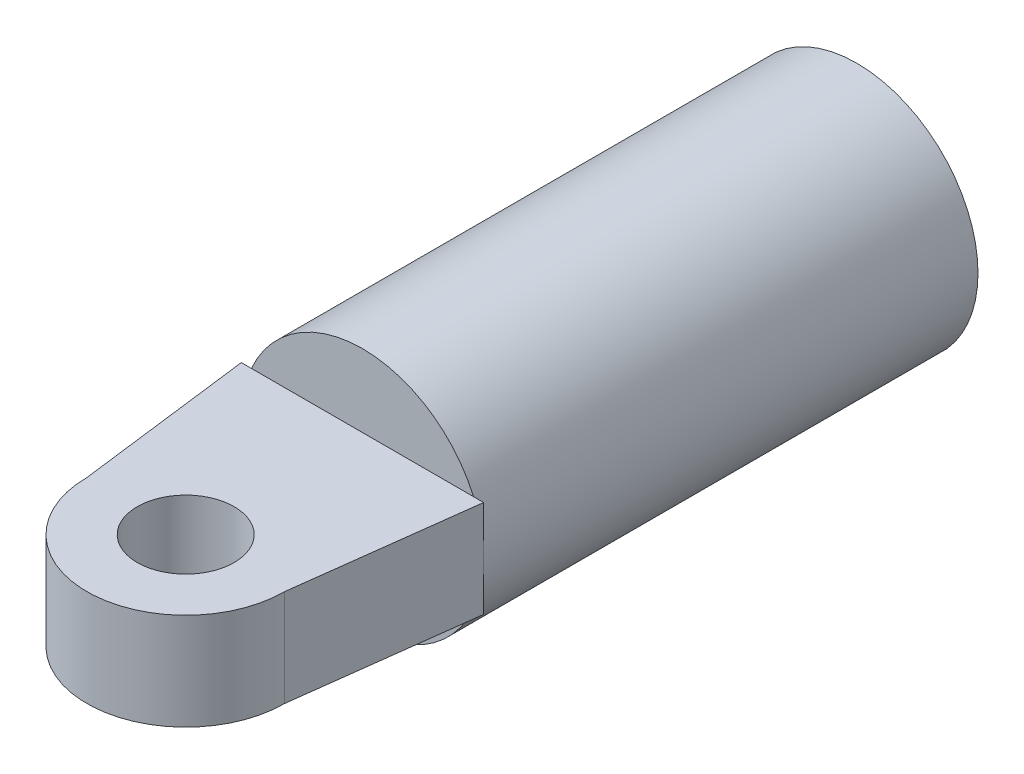
ISO-10303-21;
HEADER;
FILE_DESCRIPTION(('STEP AP214'),'2;1');
FILE_NAME('part.step','',(''),(''),'','','');
FILE_SCHEMA(('AUTOMOTIVE_DESIGN { 1 0 10303 214 1 1 1 1 }'));
ENDSEC;
DATA;
#1=APPLICATION_CONTEXT('core data for automotive mechanical design processes');
#2=APPLICATION_PROTOCOL_DEFINITION('international standard','automotive_design',2000,#1);
#3=PRODUCT_CONTEXT('',#1,'mechanical');
#4=PRODUCT('Part','Part','',(#3));
#5=PRODUCT_RELATED_PRODUCT_CATEGORY('part','',(#4));
#6=PRODUCT_DEFINITION_FORMATION('','',#4);
#7=PRODUCT_DEFINITION_CONTEXT('part definition',#1,'design');
#8=PRODUCT_DEFINITION('design','',#6,#7);
#9=PRODUCT_DEFINITION_SHAPE('','',#8);
#10=(LENGTH_UNIT() NAMED_UNIT(*) SI_UNIT(.MILLI.,.METRE.));
#11=(NAMED_UNIT(*) PLANE_ANGLE_UNIT() SI_UNIT($,.RADIAN.));
#12=(NAMED_UNIT(*) SI_UNIT($,.STERADIAN.) SOLID_ANGLE_UNIT());
#13=UNCERTAINTY_MEASURE_WITH_UNIT(LENGTH_MEASURE(1.E-05),#10,'distance_accuracy_value','');
#14=(GEOMETRIC_REPRESENTATION_CONTEXT(3) GLOBAL_UNCERTAINTY_ASSIGNED_CONTEXT((#13)) GLOBAL_UNIT_ASSIGNED_CONTEXT((#10,
#11,#12)) REPRESENTATION_CONTEXT('',''));
#15=CARTESIAN_POINT('',(0.,0.,0.));
#16=DIRECTION('',(0.,0.,1.));
#17=DIRECTION('',(1.,0.,0.));
#18=AXIS2_PLACEMENT_3D('',#15,#16,#17);
#19=CARTESIAN_POINT('',(0.,0.,51.));
#20=DIRECTION('',(0.,0.,1.));
#21=DIRECTION('',(1.,0.,0.));
#22=AXIS2_PLACEMENT_3D('',#19,#20,#21);
#23=PLANE('',#22);
#24=CARTESIAN_POINT('',(0.,0.,51.));
#25=DIRECTION('',(0.,0.,1.));
#26=DIRECTION('',(1.,0.,0.));
#27=AXIS2_PLACEMENT_3D('',#24,#25,#26);
#28=CIRCLE('',#27,12.5);
#29=CARTESIAN_POINT('',(-11.4564392373896,-5.,51.));
#30=VERTEX_POINT('',#29);
#31=CARTESIAN_POINT('',(11.4564392373896,-5.,51.));
#32=VERTEX_POINT('',#31);
#33=EDGE_CURVE('E154',#30,#32,#28,.T.);
#34=ORIENTED_EDGE('',*,*,#33,.T.);
#35=DIRECTION('',(-1.,0.,0.));
#36=VECTOR('',#35,1.);
#37=CARTESIAN_POINT('',(-12.5,-5.,51.));
#38=LINE('',#37,#36);
#39=EDGE_CURVE('E44',#32,#30,#38,.T.);
#40=ORIENTED_EDGE('',*,*,#39,.T.);
#41=EDGE_LOOP('',(#34,#40));
#42=FACE_BOUND('',#41,.T.);
#43=ADVANCED_FACE('F35',(#42),#23,.T.);
#44=CARTESIAN_POINT('',(0.,0.,51.));
#45=DIRECTION('',(0.,0.,-1.));
#46=DIRECTION('',(-1.,0.,0.));
#47=AXIS2_PLACEMENT_3D('',#44,#45,#46);
#48=CYLINDRICAL_SURFACE('',#47,12.5);
#49=CARTESIAN_POINT('',(12.5,0.,51.));
#50=VERTEX_POINT('',#49);
#51=CARTESIAN_POINT('',(11.4564392373896,5.,51.));
#52=VERTEX_POINT('',#51);
#53=EDGE_CURVE('E147',#50,#52,#28,.T.);
#54=ORIENTED_EDGE('',*,*,#53,.F.);
#55=EDGE_CURVE('E149',#32,#50,#28,.T.);
#56=ORIENTED_EDGE('',*,*,#55,.F.);
#57=ORIENTED_EDGE('',*,*,#33,.F.);
#58=CARTESIAN_POINT('',(-12.5,0.,51.));
#59=VERTEX_POINT('',#58);
#60=EDGE_CURVE('E158',#59,#30,#28,.T.);
#61=ORIENTED_EDGE('',*,*,#60,.F.);
#62=CARTESIAN_POINT('',(-11.4564392373896,5.,51.));
#63=VERTEX_POINT('',#62);
#64=EDGE_CURVE('E153',#63,#59,#28,.T.);
#65=ORIENTED_EDGE('',*,*,#64,.F.);
#66=EDGE_CURVE('E148',#52,#63,#28,.T.);
#67=ORIENTED_EDGE('',*,*,#66,.F.);
#68=EDGE_LOOP('',(#54,#56,#57,#61,#65,#67));
#69=FACE_BOUND('',#68,.T.);
#70=CARTESIAN_POINT('',(0.,0.,0.));
#71=DIRECTION('',(0.,0.,1.));
#72=DIRECTION('',(1.,0.,0.));
#73=AXIS2_PLACEMENT_3D('',#70,#71,#72);
#74=CIRCLE('',#73,12.5);
#75=CARTESIAN_POINT('',(12.5,0.,0.));
#76=VERTEX_POINT('',#75);
#77=EDGE_CURVE('E39',#76,#76,#74,.T.);
#78=ORIENTED_EDGE('',*,*,#77,.T.);
#79=EDGE_LOOP('',(#78));
#80=FACE_BOUND('',#79,.T.);
#81=ADVANCED_FACE('F37',(#69,#80),#48,.T.);
#82=DIRECTION('',(-1.,0.,0.));
#83=VECTOR('',#82,1.);
#84=CARTESIAN_POINT('',(-12.5,5.,51.));
#85=LINE('',#84,#83);
#86=EDGE_CURVE('E11',#52,#63,#85,.T.);
#87=ORIENTED_EDGE('',*,*,#86,.F.);
#88=ORIENTED_EDGE('',*,*,#66,.T.);
#89=EDGE_LOOP('',(#87,#88));
#90=FACE_BOUND('',#89,.T.);
#91=ADVANCED_FACE('F166',(#90),#23,.T.);
#92=CARTESIAN_POINT('',(0.,0.,0.));
#93=DIRECTION('',(0.,0.,1.));
#94=DIRECTION('',(1.,0.,0.));
#95=AXIS2_PLACEMENT_3D('',#92,#93,#94);
#96=PLANE('',#95);
#97=ORIENTED_EDGE('',*,*,#77,.F.);
#98=EDGE_LOOP('',(#97));
#99=FACE_BOUND('',#98,.T.);
#100=ADVANCED_FACE('F163',(#99),#96,.F.);
#101=CARTESIAN_POINT('',(-12.5,-5.,51.));
#102=DIRECTION('',(0.,0.,-1.));
#103=DIRECTION('',(-1.,0.,0.));
#104=AXIS2_PLACEMENT_3D('',#101,#102,#103);
#105=PLANE('',#104);
#106=CARTESIAN_POINT('',(-12.5,5.,51.));
#107=VERTEX_POINT('',#106);
#108=EDGE_CURVE('E47',#63,#107,#85,.T.);
#109=ORIENTED_EDGE('',*,*,#108,.F.);
#110=ORIENTED_EDGE('',*,*,#64,.T.);
#111=DIRECTION('',(0.,1.,0.));
#112=VECTOR('',#111,1.);
#113=CARTESIAN_POINT('',(-12.5,-5.,51.));
#114=LINE('',#113,#112);
#115=EDGE_CURVE('E145',#59,#107,#114,.T.);
#116=ORIENTED_EDGE('',*,*,#115,.T.);
#117=EDGE_LOOP('',(#109,#110,#116));
#118=FACE_BOUND('',#117,.T.);
#119=ADVANCED_FACE('F165',(#118),#105,.T.);
#120=CARTESIAN_POINT('',(-12.5,-5.,51.));
#121=VERTEX_POINT('',#120);
#122=EDGE_CURVE('E142',#121,#59,#114,.T.);
#123=ORIENTED_EDGE('',*,*,#122,.T.);
#124=ORIENTED_EDGE('',*,*,#60,.T.);
#125=EDGE_CURVE('E54',#30,#121,#38,.T.);
#126=ORIENTED_EDGE('',*,*,#125,.T.);
#127=EDGE_LOOP('',(#123,#124,#126));
#128=FACE_BOUND('',#127,.T.);
#129=ADVANCED_FACE('F172',(#128),#105,.T.);
#130=DIRECTION('',(0.,1.,0.));
#131=VECTOR('',#130,1.);
#132=CARTESIAN_POINT('',(12.5,-5.,51.));
#133=LINE('',#132,#131);
#134=CARTESIAN_POINT('',(12.5,5.,51.));
#135=VERTEX_POINT('',#134);
#136=EDGE_CURVE('E107',#50,#135,#133,.T.);
#137=ORIENTED_EDGE('',*,*,#136,.F.);
#138=ORIENTED_EDGE('',*,*,#53,.T.);
#139=EDGE_CURVE('E46',#135,#52,#85,.T.);
#140=ORIENTED_EDGE('',*,*,#139,.F.);
#141=EDGE_LOOP('',(#137,#138,#140));
#142=FACE_BOUND('',#141,.T.);
#143=ADVANCED_FACE('F189',(#142),#105,.T.);
#144=CARTESIAN_POINT('',(0.,-5.,69.2353941051635));
#145=DIRECTION('',(0.,1.,0.));
#146=DIRECTION('',(0.,0.,1.));
#147=AXIS2_PLACEMENT_3D('',#144,#145,#146);
#148=CYLINDRICAL_SURFACE('',#147,10.1941541977514);
#149=DIRECTION('',(0.,1.,0.));
#150=VECTOR('',#149,1.);
#151=CARTESIAN_POINT('',(10.1941541977514,-5.,69.2353941051635));
#152=LINE('',#151,#150);
#153=CARTESIAN_POINT('',(10.1941541977514,-5.,69.2353941051635));
#154=VERTEX_POINT('',#153);
#155=CARTESIAN_POINT('',(10.1941541977514,5.,69.2353941051635));
#156=VERTEX_POINT('',#155);
#157=EDGE_CURVE('E97',#154,#156,#152,.T.);
#158=ORIENTED_EDGE('',*,*,#157,.T.);
#159=CARTESIAN_POINT('',(0.,5.,69.2353941051635));
#160=DIRECTION('',(0.,1.,0.));
#161=DIRECTION('',(0.,0.,1.));
#162=AXIS2_PLACEMENT_3D('',#159,#160,#161);
#163=CIRCLE('',#162,10.1941541977514);
#164=CARTESIAN_POINT('',(-10.1941541977514,5.,69.2353941051635));
#165=VERTEX_POINT('',#164);
#166=EDGE_CURVE('E101',#165,#156,#163,.T.);
#167=ORIENTED_EDGE('',*,*,#166,.F.);
#168=DIRECTION('',(0.,1.,0.));
#169=VECTOR('',#168,1.);
#170=CARTESIAN_POINT('',(-10.1941541977514,-5.,69.2353941051635));
#171=LINE('',#170,#169);
#172=CARTESIAN_POINT('',(-10.1941541977514,-5.,69.2353941051635));
#173=VERTEX_POINT('',#172);
#174=EDGE_CURVE('E140',#173,#165,#171,.T.);
#175=ORIENTED_EDGE('',*,*,#174,.F.);
#176=CARTESIAN_POINT('',(0.,-5.,69.2353941051635));
#177=DIRECTION('',(0.,1.,0.));
#178=DIRECTION('',(0.,0.,1.));
#179=AXIS2_PLACEMENT_3D('',#176,#177,#178);
#180=CIRCLE('',#179,10.1941541977514);
#181=EDGE_CURVE('E103',#173,#154,#180,.T.);
#182=ORIENTED_EDGE('',*,*,#181,.T.);
#183=EDGE_LOOP('',(#158,#167,#175,#182));
#184=FACE_BOUND('',#183,.T.);
#185=ADVANCED_FACE('F99',(#184),#148,.T.);
#186=CARTESIAN_POINT('',(-10.1941541977514,-5.,69.2353941051635));
#187=DIRECTION('',(-0.992099948085262,0.,0.12544996217305));
#188=DIRECTION('',(0.12544996217305,0.,0.992099948085262));
#189=AXIS2_PLACEMENT_3D('',#186,#187,#188);
#190=PLANE('',#189);
#191=ORIENTED_EDGE('',*,*,#174,.T.);
#192=DIRECTION('',(0.12544996217305,0.,0.992099948085262));
#193=VECTOR('',#192,1.);
#194=CARTESIAN_POINT('',(-10.1941541977514,5.,69.2353941051635));
#195=LINE('',#194,#193);
#196=EDGE_CURVE('E123',#107,#165,#195,.T.);
#197=ORIENTED_EDGE('',*,*,#196,.F.);
#198=ORIENTED_EDGE('',*,*,#115,.F.);
#199=ORIENTED_EDGE('',*,*,#122,.F.);
#200=DIRECTION('',(0.12544996217305,0.,0.992099948085262));
#201=VECTOR('',#200,1.);
#202=CARTESIAN_POINT('',(-10.1941541977514,-5.,69.2353941051635));
#203=LINE('',#202,#201);
#204=EDGE_CURVE('E108',#121,#173,#203,.T.);
#205=ORIENTED_EDGE('',*,*,#204,.T.);
#206=EDGE_LOOP('',(#191,#197,#198,#199,#205));
#207=FACE_BOUND('',#206,.T.);
#208=ADVANCED_FACE('F188',(#207),#190,.T.);
#209=CARTESIAN_POINT('',(12.5,-5.,51.));
#210=VERTEX_POINT('',#209);
#211=EDGE_CURVE('E136',#210,#32,#38,.T.);
#212=ORIENTED_EDGE('',*,*,#211,.T.);
#213=ORIENTED_EDGE('',*,*,#55,.T.);
#214=EDGE_CURVE('E146',#210,#50,#133,.T.);
#215=ORIENTED_EDGE('',*,*,#214,.F.);
#216=EDGE_LOOP('',(#212,#213,#215));
#217=FACE_BOUND('',#216,.T.);
#218=ADVANCED_FACE('F175',(#217),#105,.T.);
#219=CARTESIAN_POINT('',(12.5,-5.,51.));
#220=DIRECTION('',(0.992099948085262,0.,0.12544996217305));
#221=DIRECTION('',(0.12544996217305,0.,-0.992099948085262));
#222=AXIS2_PLACEMENT_3D('',#219,#220,#221);
#223=PLANE('',#222);
#224=ORIENTED_EDGE('',*,*,#214,.T.);
#225=ORIENTED_EDGE('',*,*,#136,.T.);
#226=DIRECTION('',(0.12544996217305,0.,-0.992099948085262));
#227=VECTOR('',#226,1.);
#228=CARTESIAN_POINT('',(12.5,5.,51.));
#229=LINE('',#228,#227);
#230=EDGE_CURVE('E111',#156,#135,#229,.T.);
#231=ORIENTED_EDGE('',*,*,#230,.F.);
#232=ORIENTED_EDGE('',*,*,#157,.F.);
#233=DIRECTION('',(0.12544996217305,0.,-0.992099948085262));
#234=VECTOR('',#233,1.);
#235=CARTESIAN_POINT('',(12.5,-5.,51.));
#236=LINE('',#235,#234);
#237=EDGE_CURVE('E134',#154,#210,#236,.T.);
#238=ORIENTED_EDGE('',*,*,#237,.T.);
#239=EDGE_LOOP('',(#224,#225,#231,#232,#238));
#240=FACE_BOUND('',#239,.T.);
#241=ADVANCED_FACE('F113',(#240),#223,.T.);
#242=CARTESIAN_POINT('',(0.,-5.,69.2353941051635));
#243=DIRECTION('',(0.,1.,0.));
#244=DIRECTION('',(0.,0.,1.));
#245=AXIS2_PLACEMENT_3D('',#242,#243,#244);
#246=PLANE('',#245);
#247=CARTESIAN_POINT('',(0.,-5.,69.2353941051635));
#248=DIRECTION('',(0.,1.,0.));
#249=DIRECTION('',(0.,0.,1.));
#250=AXIS2_PLACEMENT_3D('',#247,#248,#249);
#251=CIRCLE('',#250,4.9995110772038);
#252=CARTESIAN_POINT('',(0.,-5.,74.2349051823673));
#253=VERTEX_POINT('',#252);
#254=EDGE_CURVE('E130',#253,#253,#251,.T.);
#255=ORIENTED_EDGE('',*,*,#254,.T.);
#256=EDGE_LOOP('',(#255));
#257=FACE_BOUND('',#256,.T.);
#258=ORIENTED_EDGE('',*,*,#181,.F.);
#259=ORIENTED_EDGE('',*,*,#204,.F.);
#260=ORIENTED_EDGE('',*,*,#125,.F.);
#261=ORIENTED_EDGE('',*,*,#39,.F.);
#262=ORIENTED_EDGE('',*,*,#211,.F.);
#263=ORIENTED_EDGE('',*,*,#237,.F.);
#264=EDGE_LOOP('',(#258,#259,#260,#261,#262,#263));
#265=FACE_BOUND('',#264,.T.);
#266=ADVANCED_FACE('F191',(#257,#265),#246,.F.);
#267=CARTESIAN_POINT('',(0.,-5.,69.2353941051635));
#268=DIRECTION('',(0.,1.,0.));
#269=DIRECTION('',(0.,0.,1.));
#270=AXIS2_PLACEMENT_3D('',#267,#268,#269);
#271=CYLINDRICAL_SURFACE('',#270,4.9995110772038);
#272=ORIENTED_EDGE('',*,*,#254,.F.);
#273=EDGE_LOOP('',(#272));
#274=FACE_BOUND('',#273,.T.);
#275=CARTESIAN_POINT('',(0.,5.,69.2353941051635));
#276=DIRECTION('',(0.,1.,0.));
#277=DIRECTION('',(0.,0.,1.));
#278=AXIS2_PLACEMENT_3D('',#275,#276,#277);
#279=CIRCLE('',#278,4.9995110772038);
#280=CARTESIAN_POINT('',(0.,5.,74.2349051823673));
#281=VERTEX_POINT('',#280);
#282=EDGE_CURVE('E124',#281,#281,#279,.T.);
#283=ORIENTED_EDGE('',*,*,#282,.T.);
#284=EDGE_LOOP('',(#283));
#285=FACE_BOUND('',#284,.T.);
#286=ADVANCED_FACE('F199',(#274,#285),#271,.F.);
#287=CARTESIAN_POINT('',(0.,5.,69.2353941051635));
#288=DIRECTION('',(0.,1.,0.));
#289=DIRECTION('',(0.,0.,1.));
#290=AXIS2_PLACEMENT_3D('',#287,#288,#289);
#291=PLANE('',#290);
#292=ORIENTED_EDGE('',*,*,#166,.T.);
#293=ORIENTED_EDGE('',*,*,#230,.T.);
#294=ORIENTED_EDGE('',*,*,#139,.T.);
#295=ORIENTED_EDGE('',*,*,#86,.T.);
#296=ORIENTED_EDGE('',*,*,#108,.T.);
#297=ORIENTED_EDGE('',*,*,#196,.T.);
#298=EDGE_LOOP('',(#292,#293,#294,#295,#296,#297));
#299=FACE_BOUND('',#298,.T.);
#300=ORIENTED_EDGE('',*,*,#282,.F.);
#301=EDGE_LOOP('',(#300));
#302=FACE_BOUND('',#301,.T.);
#303=ADVANCED_FACE('F120',(#299,#302),#291,.T.);
#304=CLOSED_SHELL('',(#43,#81,#91,#100,#119,#129,#143,#185,#208,#218,#241,#266,#286,#303));
#305=MANIFOLD_SOLID_BREP('B2',#304);
#306=ADVANCED_BREP_SHAPE_REPRESENTATION('',(#18,#305),#14);
#307=SHAPE_DEFINITION_REPRESENTATION(#9,#306);
ENDSEC;
END-ISO-10303-21;
